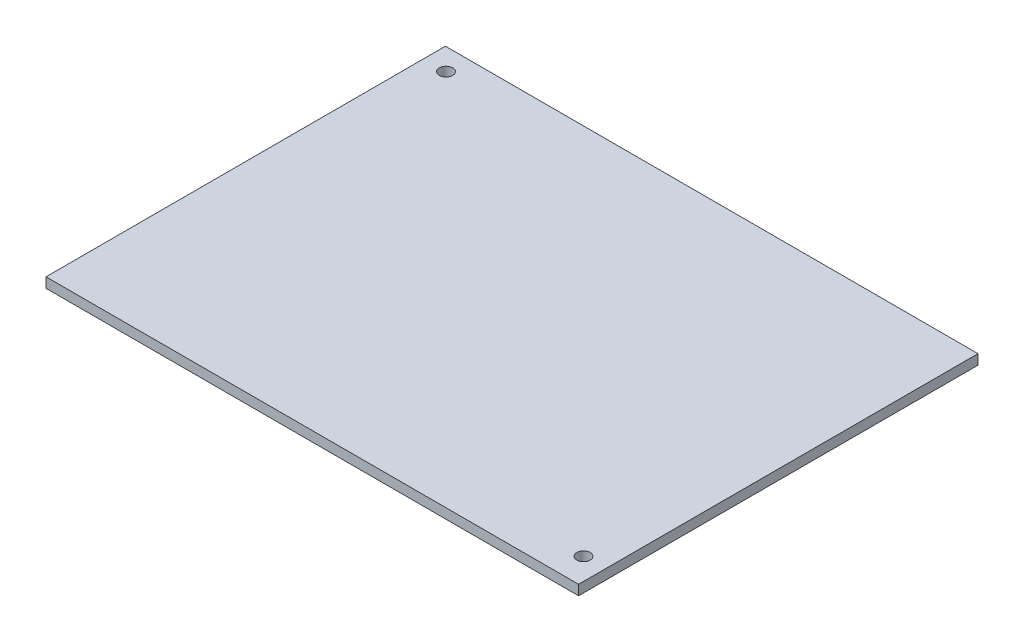
ISO-10303-21;
HEADER;
FILE_DESCRIPTION(('STEP AP214'),'2;1');
FILE_NAME('part.step','',(''),(''),'','','');
FILE_SCHEMA(('AUTOMOTIVE_DESIGN { 1 0 10303 214 1 1 1 1 }'));
ENDSEC;
DATA;
#1=APPLICATION_CONTEXT('core data for automotive mechanical design processes');
#2=APPLICATION_PROTOCOL_DEFINITION('international standard','automotive_design',2000,#1);
#3=PRODUCT_CONTEXT('',#1,'mechanical');
#4=PRODUCT('Part','Part','',(#3));
#5=PRODUCT_RELATED_PRODUCT_CATEGORY('part','',(#4));
#6=PRODUCT_DEFINITION_FORMATION('','',#4);
#7=PRODUCT_DEFINITION_CONTEXT('part definition',#1,'design');
#8=PRODUCT_DEFINITION('design','',#6,#7);
#9=PRODUCT_DEFINITION_SHAPE('','',#8);
#10=(LENGTH_UNIT() NAMED_UNIT(*) SI_UNIT(.MILLI.,.METRE.));
#11=(NAMED_UNIT(*) PLANE_ANGLE_UNIT() SI_UNIT($,.RADIAN.));
#12=(NAMED_UNIT(*) SI_UNIT($,.STERADIAN.) SOLID_ANGLE_UNIT());
#13=UNCERTAINTY_MEASURE_WITH_UNIT(LENGTH_MEASURE(1.E-05),#10,'distance_accuracy_value','');
#14=(GEOMETRIC_REPRESENTATION_CONTEXT(3) GLOBAL_UNCERTAINTY_ASSIGNED_CONTEXT((#13)) GLOBAL_UNIT_ASSIGNED_CONTEXT((#10,
#11,#12)) REPRESENTATION_CONTEXT('',''));
#15=CARTESIAN_POINT('',(0.,0.,0.));
#16=DIRECTION('',(0.,0.,1.));
#17=DIRECTION('',(1.,0.,0.));
#18=AXIS2_PLACEMENT_3D('',#15,#16,#17);
#19=CARTESIAN_POINT('',(80.,1.5,-60.));
#20=DIRECTION('',(-1.,0.,0.));
#21=DIRECTION('',(0.,0.,1.));
#22=AXIS2_PLACEMENT_3D('',#19,#20,#21);
#23=PLANE('',#22);
#24=DIRECTION('',(0.,0.,-1.));
#25=VECTOR('',#24,1.);
#26=CARTESIAN_POINT('',(80.,0.,-60.));
#27=LINE('',#26,#25);
#28=CARTESIAN_POINT('',(80.,0.,0.));
#29=VERTEX_POINT('',#28);
#30=CARTESIAN_POINT('',(80.,0.,-60.));
#31=VERTEX_POINT('',#30);
#32=EDGE_CURVE('E97',#29,#31,#27,.T.);
#33=ORIENTED_EDGE('',*,*,#32,.T.);
#34=DIRECTION('',(0.,-1.,0.));
#35=VECTOR('',#34,1.);
#36=CARTESIAN_POINT('',(80.,1.5,-60.));
#37=LINE('',#36,#35);
#38=CARTESIAN_POINT('',(80.,1.5,-60.));
#39=VERTEX_POINT('',#38);
#40=EDGE_CURVE('E11',#39,#31,#37,.T.);
#41=ORIENTED_EDGE('',*,*,#40,.F.);
#42=DIRECTION('',(0.,0.,-1.));
#43=VECTOR('',#42,1.);
#44=CARTESIAN_POINT('',(80.,1.5,-60.));
#45=LINE('',#44,#43);
#46=CARTESIAN_POINT('',(80.,1.5,0.));
#47=VERTEX_POINT('',#46);
#48=EDGE_CURVE('E85',#47,#39,#45,.T.);
#49=ORIENTED_EDGE('',*,*,#48,.F.);
#50=DIRECTION('',(0.,-1.,0.));
#51=VECTOR('',#50,1.);
#52=CARTESIAN_POINT('',(80.,1.5,0.));
#53=LINE('',#52,#51);
#54=EDGE_CURVE('E93',#47,#29,#53,.T.);
#55=ORIENTED_EDGE('',*,*,#54,.T.);
#56=EDGE_LOOP('',(#33,#41,#49,#55));
#57=FACE_BOUND('',#56,.T.);
#58=ADVANCED_FACE('F34',(#57),#23,.F.);
#59=CARTESIAN_POINT('',(80.,1.5,-60.));
#60=DIRECTION('',(0.,0.,1.));
#61=DIRECTION('',(1.,0.,0.));
#62=AXIS2_PLACEMENT_3D('',#59,#60,#61);
#63=PLANE('',#62);
#64=DIRECTION('',(-1.,0.,0.));
#65=VECTOR('',#64,1.);
#66=CARTESIAN_POINT('',(80.,0.,-60.));
#67=LINE('',#66,#65);
#68=CARTESIAN_POINT('',(0.,0.,-60.));
#69=VERTEX_POINT('',#68);
#70=EDGE_CURVE('E89',#31,#69,#67,.T.);
#71=ORIENTED_EDGE('',*,*,#70,.T.);
#72=DIRECTION('',(0.,-1.,0.));
#73=VECTOR('',#72,1.);
#74=CARTESIAN_POINT('',(0.,1.5,-60.));
#75=LINE('',#74,#73);
#76=CARTESIAN_POINT('',(0.,1.5,-60.));
#77=VERTEX_POINT('',#76);
#78=EDGE_CURVE('E42',#77,#69,#75,.T.);
#79=ORIENTED_EDGE('',*,*,#78,.F.);
#80=DIRECTION('',(-1.,0.,0.));
#81=VECTOR('',#80,1.);
#82=CARTESIAN_POINT('',(80.,1.5,-60.));
#83=LINE('',#82,#81);
#84=EDGE_CURVE('E80',#39,#77,#83,.T.);
#85=ORIENTED_EDGE('',*,*,#84,.F.);
#86=ORIENTED_EDGE('',*,*,#40,.T.);
#87=EDGE_LOOP('',(#71,#79,#85,#86));
#88=FACE_BOUND('',#87,.T.);
#89=ADVANCED_FACE('F88',(#88),#63,.F.);
#90=CARTESIAN_POINT('',(0.,1.5,-60.));
#91=DIRECTION('',(1.,0.,0.));
#92=DIRECTION('',(0.,0.,-1.));
#93=AXIS2_PLACEMENT_3D('',#90,#91,#92);
#94=PLANE('',#93);
#95=DIRECTION('',(0.,0.,1.));
#96=VECTOR('',#95,1.);
#97=CARTESIAN_POINT('',(0.,0.,-60.));
#98=LINE('',#97,#96);
#99=CARTESIAN_POINT('',(0.,0.,0.));
#100=VERTEX_POINT('',#99);
#101=EDGE_CURVE('E67',#69,#100,#98,.T.);
#102=ORIENTED_EDGE('',*,*,#101,.T.);
#103=DIRECTION('',(0.,-1.,0.));
#104=VECTOR('',#103,1.);
#105=CARTESIAN_POINT('',(0.,1.5,0.));
#106=LINE('',#105,#104);
#107=CARTESIAN_POINT('',(0.,1.5,0.));
#108=VERTEX_POINT('',#107);
#109=EDGE_CURVE('E90',#108,#100,#106,.T.);
#110=ORIENTED_EDGE('',*,*,#109,.F.);
#111=DIRECTION('',(0.,0.,1.));
#112=VECTOR('',#111,1.);
#113=CARTESIAN_POINT('',(0.,1.5,-60.));
#114=LINE('',#113,#112);
#115=EDGE_CURVE('E83',#77,#108,#114,.T.);
#116=ORIENTED_EDGE('',*,*,#115,.F.);
#117=ORIENTED_EDGE('',*,*,#78,.T.);
#118=EDGE_LOOP('',(#102,#110,#116,#117));
#119=FACE_BOUND('',#118,.T.);
#120=ADVANCED_FACE('F91',(#119),#94,.F.);
#121=CARTESIAN_POINT('',(80.,1.5,0.));
#122=DIRECTION('',(0.,0.,-1.));
#123=DIRECTION('',(-1.,0.,0.));
#124=AXIS2_PLACEMENT_3D('',#121,#122,#123);
#125=PLANE('',#124);
#126=DIRECTION('',(1.,0.,0.));
#127=VECTOR('',#126,1.);
#128=CARTESIAN_POINT('',(80.,0.,0.));
#129=LINE('',#128,#127);
#130=EDGE_CURVE('E73',#100,#29,#129,.T.);
#131=ORIENTED_EDGE('',*,*,#130,.T.);
#132=ORIENTED_EDGE('',*,*,#54,.F.);
#133=DIRECTION('',(1.,0.,0.));
#134=VECTOR('',#133,1.);
#135=CARTESIAN_POINT('',(80.,1.5,0.));
#136=LINE('',#135,#134);
#137=EDGE_CURVE('E50',#108,#47,#136,.T.);
#138=ORIENTED_EDGE('',*,*,#137,.F.);
#139=ORIENTED_EDGE('',*,*,#109,.T.);
#140=EDGE_LOOP('',(#131,#132,#138,#139));
#141=FACE_BOUND('',#140,.T.);
#142=ADVANCED_FACE('F105',(#141),#125,.F.);
#143=CARTESIAN_POINT('',(0.,1.5,0.));
#144=DIRECTION('',(0.,-1.,0.));
#145=DIRECTION('',(0.,0.,-1.));
#146=AXIS2_PLACEMENT_3D('',#143,#144,#145);
#147=PLANE('',#146);
#148=CARTESIAN_POINT('',(76.7275353199692,1.5,-4.01208744090366));
#149=DIRECTION('',(0.,1.,0.));
#150=DIRECTION('',(0.,0.,1.));
#151=AXIS2_PLACEMENT_3D('',#148,#149,#150);
#152=CIRCLE('',#151,0.999999999999998);
#153=CARTESIAN_POINT('',(76.7275353199692,1.5,-3.01208744090366));
#154=VERTEX_POINT('',#153);
#155=EDGE_CURVE('E119',#154,#154,#152,.T.);
#156=ORIENTED_EDGE('',*,*,#155,.F.);
#157=EDGE_LOOP('',(#156));
#158=FACE_BOUND('',#157,.T.);
#159=CARTESIAN_POINT('',(3.35534798767229,1.5,-56.7337950564308));
#160=DIRECTION('',(0.,1.,0.));
#161=DIRECTION('',(0.,0.,1.));
#162=AXIS2_PLACEMENT_3D('',#159,#160,#161);
#163=CIRCLE('',#162,1.);
#164=CARTESIAN_POINT('',(3.35534798767229,1.5,-55.7337950564308));
#165=VERTEX_POINT('',#164);
#166=EDGE_CURVE('E113',#165,#165,#163,.T.);
#167=ORIENTED_EDGE('',*,*,#166,.F.);
#168=EDGE_LOOP('',(#167));
#169=FACE_BOUND('',#168,.T.);
#170=ORIENTED_EDGE('',*,*,#48,.T.);
#171=ORIENTED_EDGE('',*,*,#84,.T.);
#172=ORIENTED_EDGE('',*,*,#115,.T.);
#173=ORIENTED_EDGE('',*,*,#137,.T.);
#174=EDGE_LOOP('',(#170,#171,#172,#173));
#175=FACE_BOUND('',#174,.T.);
#176=ADVANCED_FACE('F81',(#158,#169,#175),#147,.F.);
#177=CARTESIAN_POINT('',(0.,0.,0.));
#178=DIRECTION('',(0.,-1.,0.));
#179=DIRECTION('',(0.,0.,-1.));
#180=AXIS2_PLACEMENT_3D('',#177,#178,#179);
#181=PLANE('',#180);
#182=CARTESIAN_POINT('',(76.7275353199692,0.,-4.01208744090366));
#183=DIRECTION('',(0.,-1.,0.));
#184=DIRECTION('',(0.,0.,-1.));
#185=AXIS2_PLACEMENT_3D('',#182,#183,#184);
#186=CIRCLE('',#185,0.999999999999998);
#187=CARTESIAN_POINT('',(76.7275353199692,0.,-5.01208744090366));
#188=VERTEX_POINT('',#187);
#189=EDGE_CURVE('E116',#188,#188,#186,.F.);
#190=ORIENTED_EDGE('',*,*,#189,.T.);
#191=EDGE_LOOP('',(#190));
#192=FACE_BOUND('',#191,.T.);
#193=CARTESIAN_POINT('',(3.35534798767229,0.,-56.7337950564308));
#194=DIRECTION('',(0.,-1.,0.));
#195=DIRECTION('',(0.,0.,-1.));
#196=AXIS2_PLACEMENT_3D('',#193,#194,#195);
#197=CIRCLE('',#196,1.);
#198=CARTESIAN_POINT('',(3.35534798767229,0.,-57.7337950564308));
#199=VERTEX_POINT('',#198);
#200=EDGE_CURVE('E100',#199,#199,#197,.F.);
#201=ORIENTED_EDGE('',*,*,#200,.T.);
#202=EDGE_LOOP('',(#201));
#203=FACE_BOUND('',#202,.T.);
#204=ORIENTED_EDGE('',*,*,#32,.F.);
#205=ORIENTED_EDGE('',*,*,#130,.F.);
#206=ORIENTED_EDGE('',*,*,#101,.F.);
#207=ORIENTED_EDGE('',*,*,#70,.F.);
#208=EDGE_LOOP('',(#204,#205,#206,#207));
#209=FACE_BOUND('',#208,.T.);
#210=ADVANCED_FACE('F108',(#192,#203,#209),#181,.T.);
#211=CARTESIAN_POINT('',(3.35534798767229,-2.82842712474619,-56.7337950564308));
#212=DIRECTION('',(0.,1.,0.));
#213=DIRECTION('',(0.,0.,1.));
#214=AXIS2_PLACEMENT_3D('',#211,#212,#213);
#215=CYLINDRICAL_SURFACE('',#214,1.);
#216=ORIENTED_EDGE('',*,*,#166,.T.);
#217=EDGE_LOOP('',(#216));
#218=FACE_BOUND('',#217,.T.);
#219=ORIENTED_EDGE('',*,*,#200,.F.);
#220=EDGE_LOOP('',(#219));
#221=FACE_BOUND('',#220,.T.);
#222=ADVANCED_FACE('F131',(#218,#221),#215,.F.);
#223=CARTESIAN_POINT('',(76.7275353199692,-2.82842712474619,-4.01208744090366));
#224=DIRECTION('',(0.,1.,0.));
#225=DIRECTION('',(0.,0.,1.));
#226=AXIS2_PLACEMENT_3D('',#223,#224,#225);
#227=CYLINDRICAL_SURFACE('',#226,0.999999999999998);
#228=ORIENTED_EDGE('',*,*,#155,.T.);
#229=EDGE_LOOP('',(#228));
#230=FACE_BOUND('',#229,.T.);
#231=ORIENTED_EDGE('',*,*,#189,.F.);
#232=EDGE_LOOP('',(#231));
#233=FACE_BOUND('',#232,.T.);
#234=ADVANCED_FACE('F123',(#230,#233),#227,.F.);
#235=CLOSED_SHELL('',(#58,#89,#120,#142,#176,#210,#222,#234));
#236=MANIFOLD_SOLID_BREP('B2',#235);
#237=ADVANCED_BREP_SHAPE_REPRESENTATION('',(#18,#236),#14);
#238=SHAPE_DEFINITION_REPRESENTATION(#9,#237);
ENDSEC;
END-ISO-10303-21;
